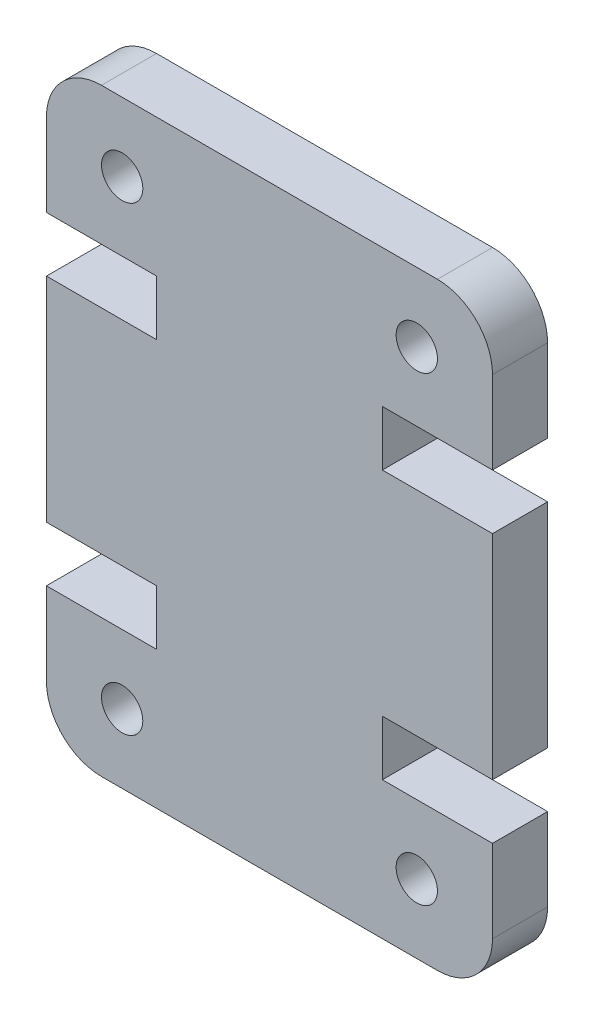
ISO-10303-21;
HEADER;
FILE_DESCRIPTION(('STEP AP214'),'2;1');
FILE_NAME('part.step','',(''),(''),'','','');
FILE_SCHEMA(('AUTOMOTIVE_DESIGN { 1 0 10303 214 1 1 1 1 }'));
ENDSEC;
DATA;
#1=APPLICATION_CONTEXT('core data for automotive mechanical design processes');
#2=APPLICATION_PROTOCOL_DEFINITION('international standard','automotive_design',2000,#1);
#3=PRODUCT_CONTEXT('',#1,'mechanical');
#4=PRODUCT('Part','Part','',(#3));
#5=PRODUCT_RELATED_PRODUCT_CATEGORY('part','',(#4));
#6=PRODUCT_DEFINITION_FORMATION('','',#4);
#7=PRODUCT_DEFINITION_CONTEXT('part definition',#1,'design');
#8=PRODUCT_DEFINITION('design','',#6,#7);
#9=PRODUCT_DEFINITION_SHAPE('','',#8);
#10=(LENGTH_UNIT() NAMED_UNIT(*) SI_UNIT(.MILLI.,.METRE.));
#11=(NAMED_UNIT(*) PLANE_ANGLE_UNIT() SI_UNIT($,.RADIAN.));
#12=(NAMED_UNIT(*) SI_UNIT($,.STERADIAN.) SOLID_ANGLE_UNIT());
#13=UNCERTAINTY_MEASURE_WITH_UNIT(LENGTH_MEASURE(1.E-05),#10,'distance_accuracy_value','');
#14=(GEOMETRIC_REPRESENTATION_CONTEXT(3) GLOBAL_UNCERTAINTY_ASSIGNED_CONTEXT((#13)) GLOBAL_UNIT_ASSIGNED_CONTEXT((#10,
#11,#12)) REPRESENTATION_CONTEXT('',''));
#15=CARTESIAN_POINT('',(0.,0.,0.));
#16=DIRECTION('',(0.,0.,1.));
#17=DIRECTION('',(1.,0.,0.));
#18=AXIS2_PLACEMENT_3D('',#15,#16,#17);
#19=CARTESIAN_POINT('',(14.2,2.,2.));
#20=DIRECTION('',(0.,0.,-1.));
#21=DIRECTION('',(-1.,0.,0.));
#22=AXIS2_PLACEMENT_3D('',#19,#20,#21);
#23=PLANE('',#22);
#24=CARTESIAN_POINT('',(2.75000000000004,19.2399999999998,2.));
#25=DIRECTION('',(0.,0.,1.));
#26=DIRECTION('',(-1.,0.,0.));
#27=AXIS2_PLACEMENT_3D('',#24,#25,#26);
#28=CIRCLE('',#27,0.75);
#29=CARTESIAN_POINT('',(2.00000000000004,19.2399999999998,2.));
#30=VERTEX_POINT('',#29);
#31=EDGE_CURVE('E448',#30,#30,#28,.T.);
#32=ORIENTED_EDGE('',*,*,#31,.F.);
#33=EDGE_LOOP('',(#32));
#34=FACE_BOUND('',#33,.T.);
#35=CARTESIAN_POINT('',(13.45,2.50000000000017,2.));
#36=DIRECTION('',(0.,0.,1.));
#37=DIRECTION('',(-1.,0.,0.));
#38=AXIS2_PLACEMENT_3D('',#35,#36,#37);
#39=CIRCLE('',#38,0.750000000000004);
#40=CARTESIAN_POINT('',(12.6999999999999,2.50000000000017,2.));
#41=VERTEX_POINT('',#40);
#42=EDGE_CURVE('E230',#41,#41,#39,.T.);
#43=ORIENTED_EDGE('',*,*,#42,.F.);
#44=EDGE_LOOP('',(#43));
#45=FACE_BOUND('',#44,.T.);
#46=CARTESIAN_POINT('',(14.2,2.,2.));
#47=DIRECTION('',(0.,0.,1.));
#48=DIRECTION('',(-1.,0.,0.));
#49=AXIS2_PLACEMENT_3D('',#46,#47,#48);
#50=CIRCLE('',#49,2.);
#51=CARTESIAN_POINT('',(14.2,0.,2.));
#52=VERTEX_POINT('',#51);
#53=CARTESIAN_POINT('',(16.2,2.,2.));
#54=VERTEX_POINT('',#53);
#55=EDGE_CURVE('E273',#52,#54,#50,.T.);
#56=ORIENTED_EDGE('',*,*,#55,.T.);
#57=DIRECTION('',(0.,1.,0.));
#58=VECTOR('',#57,1.);
#59=CARTESIAN_POINT('',(16.2,2.,2.));
#60=LINE('',#59,#58);
#61=CARTESIAN_POINT('',(16.2,4.99999999999945,2.));
#62=VERTEX_POINT('',#61);
#63=EDGE_CURVE('E141',#54,#62,#60,.T.);
#64=ORIENTED_EDGE('',*,*,#63,.T.);
#65=DIRECTION('',(-1.,0.,0.));
#66=VECTOR('',#65,1.);
#67=CARTESIAN_POINT('',(12.2,4.99999999999945,2.));
#68=LINE('',#67,#66);
#69=CARTESIAN_POINT('',(12.2,4.99999999999945,2.));
#70=VERTEX_POINT('',#69);
#71=EDGE_CURVE('E336',#62,#70,#68,.T.);
#72=ORIENTED_EDGE('',*,*,#71,.T.);
#73=DIRECTION('',(0.,1.,0.));
#74=VECTOR('',#73,1.);
#75=CARTESIAN_POINT('',(12.2,6.99999999999945,2.));
#76=LINE('',#75,#74);
#77=CARTESIAN_POINT('',(12.2,6.99999999999945,2.));
#78=VERTEX_POINT('',#77);
#79=EDGE_CURVE('E355',#70,#78,#76,.T.);
#80=ORIENTED_EDGE('',*,*,#79,.T.);
#81=DIRECTION('',(1.,0.,0.));
#82=VECTOR('',#81,1.);
#83=CARTESIAN_POINT('',(16.2,6.99999999999945,2.));
#84=LINE('',#83,#82);
#85=CARTESIAN_POINT('',(16.2,6.99999999999945,2.));
#86=VERTEX_POINT('',#85);
#87=EDGE_CURVE('E352',#78,#86,#84,.T.);
#88=ORIENTED_EDGE('',*,*,#87,.T.);
#89=DIRECTION('',(0.,1.,0.));
#90=VECTOR('',#89,1.);
#91=CARTESIAN_POINT('',(16.2,14.7400000000005,2.));
#92=LINE('',#91,#90);
#93=CARTESIAN_POINT('',(16.2,14.7400000000005,2.));
#94=VERTEX_POINT('',#93);
#95=EDGE_CURVE('E354',#86,#94,#92,.T.);
#96=ORIENTED_EDGE('',*,*,#95,.T.);
#97=DIRECTION('',(-1.,0.,0.));
#98=VECTOR('',#97,1.);
#99=CARTESIAN_POINT('',(16.2,14.7400000000005,2.));
#100=LINE('',#99,#98);
#101=CARTESIAN_POINT('',(12.2,14.7400000000005,2.));
#102=VERTEX_POINT('',#101);
#103=EDGE_CURVE('E357',#94,#102,#100,.T.);
#104=ORIENTED_EDGE('',*,*,#103,.T.);
#105=DIRECTION('',(0.,1.,0.));
#106=VECTOR('',#105,1.);
#107=CARTESIAN_POINT('',(12.2,14.7400000000005,2.));
#108=LINE('',#107,#106);
#109=CARTESIAN_POINT('',(12.2,16.7400000000005,2.));
#110=VERTEX_POINT('',#109);
#111=EDGE_CURVE('E363',#102,#110,#108,.T.);
#112=ORIENTED_EDGE('',*,*,#111,.T.);
#113=DIRECTION('',(1.,0.,0.));
#114=VECTOR('',#113,1.);
#115=CARTESIAN_POINT('',(12.2,16.7400000000005,2.));
#116=LINE('',#115,#114);
#117=CARTESIAN_POINT('',(16.2,16.7400000000005,2.));
#118=VERTEX_POINT('',#117);
#119=EDGE_CURVE('E365',#110,#118,#116,.T.);
#120=ORIENTED_EDGE('',*,*,#119,.T.);
#121=DIRECTION('',(0.,1.,0.));
#122=VECTOR('',#121,1.);
#123=CARTESIAN_POINT('',(16.2,19.74,2.));
#124=LINE('',#123,#122);
#125=CARTESIAN_POINT('',(16.2,19.74,2.));
#126=VERTEX_POINT('',#125);
#127=EDGE_CURVE('E367',#118,#126,#124,.T.);
#128=ORIENTED_EDGE('',*,*,#127,.T.);
#129=CARTESIAN_POINT('',(14.2,19.74,2.));
#130=DIRECTION('',(0.,0.,1.));
#131=DIRECTION('',(1.,0.,0.));
#132=AXIS2_PLACEMENT_3D('',#129,#130,#131);
#133=CIRCLE('',#132,2.);
#134=CARTESIAN_POINT('',(14.2,21.74,2.));
#135=VERTEX_POINT('',#134);
#136=EDGE_CURVE('E369',#126,#135,#133,.T.);
#137=ORIENTED_EDGE('',*,*,#136,.T.);
#138=DIRECTION('',(-1.,0.,0.));
#139=VECTOR('',#138,1.);
#140=CARTESIAN_POINT('',(1.99999999999999,21.74,2.));
#141=LINE('',#140,#139);
#142=CARTESIAN_POINT('',(1.99999999999999,21.74,2.));
#143=VERTEX_POINT('',#142);
#144=EDGE_CURVE('E371',#135,#143,#141,.T.);
#145=ORIENTED_EDGE('',*,*,#144,.T.);
#146=CARTESIAN_POINT('',(2.,19.74,2.));
#147=DIRECTION('',(0.,0.,1.));
#148=DIRECTION('',(-1.,0.,0.));
#149=AXIS2_PLACEMENT_3D('',#146,#147,#148);
#150=CIRCLE('',#149,2.);
#151=CARTESIAN_POINT('',(0.,19.74,2.));
#152=VERTEX_POINT('',#151);
#153=EDGE_CURVE('E373',#143,#152,#150,.T.);
#154=ORIENTED_EDGE('',*,*,#153,.T.);
#155=DIRECTION('',(0.,-1.,0.));
#156=VECTOR('',#155,1.);
#157=CARTESIAN_POINT('',(0.,19.74,2.));
#158=LINE('',#157,#156);
#159=CARTESIAN_POINT('',(0.,16.7400000000005,2.));
#160=VERTEX_POINT('',#159);
#161=EDGE_CURVE('E375',#152,#160,#158,.T.);
#162=ORIENTED_EDGE('',*,*,#161,.T.);
#163=DIRECTION('',(1.,0.,0.));
#164=VECTOR('',#163,1.);
#165=CARTESIAN_POINT('',(4.,16.7400000000005,2.));
#166=LINE('',#165,#164);
#167=CARTESIAN_POINT('',(4.,16.7400000000005,2.));
#168=VERTEX_POINT('',#167);
#169=EDGE_CURVE('E377',#160,#168,#166,.T.);
#170=ORIENTED_EDGE('',*,*,#169,.T.);
#171=DIRECTION('',(0.,-1.,0.));
#172=VECTOR('',#171,1.);
#173=CARTESIAN_POINT('',(4.,14.7400000000005,2.));
#174=LINE('',#173,#172);
#175=CARTESIAN_POINT('',(4.,14.7400000000005,2.));
#176=VERTEX_POINT('',#175);
#177=EDGE_CURVE('E379',#168,#176,#174,.T.);
#178=ORIENTED_EDGE('',*,*,#177,.T.);
#179=DIRECTION('',(-1.,0.,0.));
#180=VECTOR('',#179,1.);
#181=CARTESIAN_POINT('',(0.,14.7400000000005,2.));
#182=LINE('',#181,#180);
#183=CARTESIAN_POINT('',(0.,14.7400000000005,2.));
#184=VERTEX_POINT('',#183);
#185=EDGE_CURVE('E381',#176,#184,#182,.T.);
#186=ORIENTED_EDGE('',*,*,#185,.T.);
#187=DIRECTION('',(0.,-1.,0.));
#188=VECTOR('',#187,1.);
#189=CARTESIAN_POINT('',(0.,14.7400000000005,2.));
#190=LINE('',#189,#188);
#191=CARTESIAN_POINT('',(0.,6.99999999999946,2.));
#192=VERTEX_POINT('',#191);
#193=EDGE_CURVE('E383',#184,#192,#190,.T.);
#194=ORIENTED_EDGE('',*,*,#193,.T.);
#195=DIRECTION('',(1.,0.,0.));
#196=VECTOR('',#195,1.);
#197=CARTESIAN_POINT('',(0.,6.99999999999946,2.));
#198=LINE('',#197,#196);
#199=CARTESIAN_POINT('',(4.00000000000002,6.99999999999946,2.));
#200=VERTEX_POINT('',#199);
#201=EDGE_CURVE('E385',#192,#200,#198,.T.);
#202=ORIENTED_EDGE('',*,*,#201,.T.);
#203=DIRECTION('',(0.,-1.,0.));
#204=VECTOR('',#203,1.);
#205=CARTESIAN_POINT('',(4.00000000000002,6.99999999999946,2.));
#206=LINE('',#205,#204);
#207=CARTESIAN_POINT('',(4.,4.99999999999945,2.));
#208=VERTEX_POINT('',#207);
#209=EDGE_CURVE('E387',#200,#208,#206,.T.);
#210=ORIENTED_EDGE('',*,*,#209,.T.);
#211=DIRECTION('',(-1.,0.,0.));
#212=VECTOR('',#211,1.);
#213=CARTESIAN_POINT('',(4.,4.99999999999945,2.));
#214=LINE('',#213,#212);
#215=CARTESIAN_POINT('',(0.,4.99999999999945,2.));
#216=VERTEX_POINT('',#215);
#217=EDGE_CURVE('E208',#208,#216,#214,.T.);
#218=ORIENTED_EDGE('',*,*,#217,.T.);
#219=DIRECTION('',(0.,-1.,0.));
#220=VECTOR('',#219,1.);
#221=CARTESIAN_POINT('',(0.,2.,2.));
#222=LINE('',#221,#220);
#223=CARTESIAN_POINT('',(0.,2.,2.));
#224=VERTEX_POINT('',#223);
#225=EDGE_CURVE('E202',#216,#224,#222,.T.);
#226=ORIENTED_EDGE('',*,*,#225,.T.);
#227=CARTESIAN_POINT('',(2.00000000000002,2.,2.));
#228=DIRECTION('',(0.,0.,1.));
#229=DIRECTION('',(1.,0.,0.));
#230=AXIS2_PLACEMENT_3D('',#227,#228,#229);
#231=CIRCLE('',#230,2.00000000000001);
#232=CARTESIAN_POINT('',(2.00000000000002,0.,2.));
#233=VERTEX_POINT('',#232);
#234=EDGE_CURVE('E206',#224,#233,#231,.T.);
#235=ORIENTED_EDGE('',*,*,#234,.T.);
#236=DIRECTION('',(1.,0.,0.));
#237=VECTOR('',#236,1.);
#238=CARTESIAN_POINT('',(2.00000000000002,0.,2.));
#239=LINE('',#238,#237);
#240=EDGE_CURVE('E50',#233,#52,#239,.T.);
#241=ORIENTED_EDGE('',*,*,#240,.T.);
#242=EDGE_LOOP('',(#56,#64,#72,#80,#88,#96,#104,#112,#120,#128,#137,#145,#154,#162,#170,#178,
#186,#194,#202,#210,#218,#226,#235,#241));
#243=FACE_BOUND('',#242,.T.);
#244=CARTESIAN_POINT('',(2.75000000000004,2.50000000000017,2.));
#245=DIRECTION('',(0.,0.,1.));
#246=DIRECTION('',(1.,0.,0.));
#247=AXIS2_PLACEMENT_3D('',#244,#245,#246);
#248=CIRCLE('',#247,0.75);
#249=CARTESIAN_POINT('',(3.50000000000004,2.50000000000017,2.));
#250=VERTEX_POINT('',#249);
#251=EDGE_CURVE('E454',#250,#250,#248,.T.);
#252=ORIENTED_EDGE('',*,*,#251,.F.);
#253=EDGE_LOOP('',(#252));
#254=FACE_BOUND('',#253,.T.);
#255=CARTESIAN_POINT('',(13.45,19.2399999999998,2.));
#256=DIRECTION('',(0.,0.,1.));
#257=DIRECTION('',(1.,0.,0.));
#258=AXIS2_PLACEMENT_3D('',#255,#256,#257);
#259=CIRCLE('',#258,0.750000000000004);
#260=CARTESIAN_POINT('',(14.2,19.2399999999998,2.));
#261=VERTEX_POINT('',#260);
#262=EDGE_CURVE('E439',#261,#261,#259,.T.);
#263=ORIENTED_EDGE('',*,*,#262,.F.);
#264=EDGE_LOOP('',(#263));
#265=FACE_BOUND('',#264,.T.);
#266=ADVANCED_FACE('F33',(#34,#45,#243,#254,#265),#23,.F.);
#267=CARTESIAN_POINT('',(14.2,2.,0.));
#268=DIRECTION('',(0.,0.,-1.));
#269=DIRECTION('',(-1.,0.,0.));
#270=AXIS2_PLACEMENT_3D('',#267,#268,#269);
#271=PLANE('',#270);
#272=CARTESIAN_POINT('',(2.75000000000004,19.2399999999998,0.));
#273=DIRECTION('',(0.,0.,1.));
#274=DIRECTION('',(-1.,0.,0.));
#275=AXIS2_PLACEMENT_3D('',#272,#273,#274);
#276=CIRCLE('',#275,0.75);
#277=CARTESIAN_POINT('',(2.00000000000004,19.2399999999998,0.));
#278=VERTEX_POINT('',#277);
#279=EDGE_CURVE('E445',#278,#278,#276,.T.);
#280=ORIENTED_EDGE('',*,*,#279,.T.);
#281=EDGE_LOOP('',(#280));
#282=FACE_BOUND('',#281,.T.);
#283=CARTESIAN_POINT('',(13.45,2.50000000000017,0.));
#284=DIRECTION('',(0.,0.,1.));
#285=DIRECTION('',(-1.,0.,0.));
#286=AXIS2_PLACEMENT_3D('',#283,#284,#285);
#287=CIRCLE('',#286,0.750000000000004);
#288=CARTESIAN_POINT('',(12.6999999999999,2.50000000000017,0.));
#289=VERTEX_POINT('',#288);
#290=EDGE_CURVE('E457',#289,#289,#287,.T.);
#291=ORIENTED_EDGE('',*,*,#290,.T.);
#292=EDGE_LOOP('',(#291));
#293=FACE_BOUND('',#292,.T.);
#294=CARTESIAN_POINT('',(14.2,2.,0.));
#295=DIRECTION('',(0.,0.,1.));
#296=DIRECTION('',(-1.,0.,0.));
#297=AXIS2_PLACEMENT_3D('',#294,#295,#296);
#298=CIRCLE('',#297,2.);
#299=CARTESIAN_POINT('',(14.2,0.,0.));
#300=VERTEX_POINT('',#299);
#301=CARTESIAN_POINT('',(16.2,2.,0.));
#302=VERTEX_POINT('',#301);
#303=EDGE_CURVE('E226',#300,#302,#298,.T.);
#304=ORIENTED_EDGE('',*,*,#303,.F.);
#305=DIRECTION('',(1.,0.,0.));
#306=VECTOR('',#305,1.);
#307=CARTESIAN_POINT('',(2.00000000000002,0.,0.));
#308=LINE('',#307,#306);
#309=CARTESIAN_POINT('',(2.00000000000002,0.,0.));
#310=VERTEX_POINT('',#309);
#311=EDGE_CURVE('E133',#310,#300,#308,.T.);
#312=ORIENTED_EDGE('',*,*,#311,.F.);
#313=CARTESIAN_POINT('',(2.00000000000002,2.,0.));
#314=DIRECTION('',(0.,0.,1.));
#315=DIRECTION('',(1.,0.,0.));
#316=AXIS2_PLACEMENT_3D('',#313,#314,#315);
#317=CIRCLE('',#316,2.00000000000001);
#318=CARTESIAN_POINT('',(0.,2.,0.));
#319=VERTEX_POINT('',#318);
#320=EDGE_CURVE('E127',#319,#310,#317,.T.);
#321=ORIENTED_EDGE('',*,*,#320,.F.);
#322=DIRECTION('',(0.,-1.,0.));
#323=VECTOR('',#322,1.);
#324=CARTESIAN_POINT('',(0.,2.,0.));
#325=LINE('',#324,#323);
#326=CARTESIAN_POINT('',(0.,4.99999999999945,0.));
#327=VERTEX_POINT('',#326);
#328=EDGE_CURVE('E216',#327,#319,#325,.T.);
#329=ORIENTED_EDGE('',*,*,#328,.F.);
#330=DIRECTION('',(-1.,0.,0.));
#331=VECTOR('',#330,1.);
#332=CARTESIAN_POINT('',(4.,4.99999999999945,0.));
#333=LINE('',#332,#331);
#334=CARTESIAN_POINT('',(4.,4.99999999999945,0.));
#335=VERTEX_POINT('',#334);
#336=EDGE_CURVE('E268',#335,#327,#333,.T.);
#337=ORIENTED_EDGE('',*,*,#336,.F.);
#338=DIRECTION('',(0.,-1.,0.));
#339=VECTOR('',#338,1.);
#340=CARTESIAN_POINT('',(4.00000000000002,6.99999999999946,0.));
#341=LINE('',#340,#339);
#342=CARTESIAN_POINT('',(4.00000000000002,6.99999999999946,0.));
#343=VERTEX_POINT('',#342);
#344=EDGE_CURVE('E266',#343,#335,#341,.T.);
#345=ORIENTED_EDGE('',*,*,#344,.F.);
#346=DIRECTION('',(1.,0.,0.));
#347=VECTOR('',#346,1.);
#348=CARTESIAN_POINT('',(0.,6.99999999999946,0.));
#349=LINE('',#348,#347);
#350=CARTESIAN_POINT('',(0.,6.99999999999946,0.));
#351=VERTEX_POINT('',#350);
#352=EDGE_CURVE('E264',#351,#343,#349,.T.);
#353=ORIENTED_EDGE('',*,*,#352,.F.);
#354=DIRECTION('',(0.,-1.,0.));
#355=VECTOR('',#354,1.);
#356=CARTESIAN_POINT('',(0.,14.7400000000005,0.));
#357=LINE('',#356,#355);
#358=CARTESIAN_POINT('',(0.,14.7400000000005,0.));
#359=VERTEX_POINT('',#358);
#360=EDGE_CURVE('E262',#359,#351,#357,.T.);
#361=ORIENTED_EDGE('',*,*,#360,.F.);
#362=DIRECTION('',(-1.,0.,0.));
#363=VECTOR('',#362,1.);
#364=CARTESIAN_POINT('',(0.,14.7400000000005,0.));
#365=LINE('',#364,#363);
#366=CARTESIAN_POINT('',(4.,14.7400000000005,0.));
#367=VERTEX_POINT('',#366);
#368=EDGE_CURVE('E260',#367,#359,#365,.T.);
#369=ORIENTED_EDGE('',*,*,#368,.F.);
#370=DIRECTION('',(0.,-1.,0.));
#371=VECTOR('',#370,1.);
#372=CARTESIAN_POINT('',(4.,14.7400000000005,0.));
#373=LINE('',#372,#371);
#374=CARTESIAN_POINT('',(4.,16.7400000000005,0.));
#375=VERTEX_POINT('',#374);
#376=EDGE_CURVE('E258',#375,#367,#373,.T.);
#377=ORIENTED_EDGE('',*,*,#376,.F.);
#378=DIRECTION('',(1.,0.,0.));
#379=VECTOR('',#378,1.);
#380=CARTESIAN_POINT('',(4.,16.7400000000005,0.));
#381=LINE('',#380,#379);
#382=CARTESIAN_POINT('',(0.,16.7400000000005,0.));
#383=VERTEX_POINT('',#382);
#384=EDGE_CURVE('E256',#383,#375,#381,.T.);
#385=ORIENTED_EDGE('',*,*,#384,.F.);
#386=DIRECTION('',(0.,-1.,0.));
#387=VECTOR('',#386,1.);
#388=CARTESIAN_POINT('',(0.,19.74,0.));
#389=LINE('',#388,#387);
#390=CARTESIAN_POINT('',(0.,19.74,0.));
#391=VERTEX_POINT('',#390);
#392=EDGE_CURVE('E254',#391,#383,#389,.T.);
#393=ORIENTED_EDGE('',*,*,#392,.F.);
#394=CARTESIAN_POINT('',(2.,19.74,0.));
#395=DIRECTION('',(0.,0.,1.));
#396=DIRECTION('',(-1.,0.,0.));
#397=AXIS2_PLACEMENT_3D('',#394,#395,#396);
#398=CIRCLE('',#397,2.);
#399=CARTESIAN_POINT('',(1.99999999999999,21.74,0.));
#400=VERTEX_POINT('',#399);
#401=EDGE_CURVE('E252',#400,#391,#398,.T.);
#402=ORIENTED_EDGE('',*,*,#401,.F.);
#403=DIRECTION('',(-1.,0.,0.));
#404=VECTOR('',#403,1.);
#405=CARTESIAN_POINT('',(1.99999999999999,21.74,0.));
#406=LINE('',#405,#404);
#407=CARTESIAN_POINT('',(14.2,21.74,0.));
#408=VERTEX_POINT('',#407);
#409=EDGE_CURVE('E250',#408,#400,#406,.T.);
#410=ORIENTED_EDGE('',*,*,#409,.F.);
#411=CARTESIAN_POINT('',(14.2,19.74,0.));
#412=DIRECTION('',(0.,0.,1.));
#413=DIRECTION('',(1.,0.,0.));
#414=AXIS2_PLACEMENT_3D('',#411,#412,#413);
#415=CIRCLE('',#414,2.);
#416=CARTESIAN_POINT('',(16.2,19.74,0.));
#417=VERTEX_POINT('',#416);
#418=EDGE_CURVE('E248',#417,#408,#415,.T.);
#419=ORIENTED_EDGE('',*,*,#418,.F.);
#420=DIRECTION('',(0.,1.,0.));
#421=VECTOR('',#420,1.);
#422=CARTESIAN_POINT('',(16.2,19.74,0.));
#423=LINE('',#422,#421);
#424=CARTESIAN_POINT('',(16.2,16.7400000000005,0.));
#425=VERTEX_POINT('',#424);
#426=EDGE_CURVE('E246',#425,#417,#423,.T.);
#427=ORIENTED_EDGE('',*,*,#426,.F.);
#428=DIRECTION('',(1.,0.,0.));
#429=VECTOR('',#428,1.);
#430=CARTESIAN_POINT('',(12.2,16.7400000000005,0.));
#431=LINE('',#430,#429);
#432=CARTESIAN_POINT('',(12.2,16.7400000000005,0.));
#433=VERTEX_POINT('',#432);
#434=EDGE_CURVE('E244',#433,#425,#431,.T.);
#435=ORIENTED_EDGE('',*,*,#434,.F.);
#436=DIRECTION('',(0.,1.,0.));
#437=VECTOR('',#436,1.);
#438=CARTESIAN_POINT('',(12.2,14.7400000000005,0.));
#439=LINE('',#438,#437);
#440=CARTESIAN_POINT('',(12.2,14.7400000000005,0.));
#441=VERTEX_POINT('',#440);
#442=EDGE_CURVE('E242',#441,#433,#439,.T.);
#443=ORIENTED_EDGE('',*,*,#442,.F.);
#444=DIRECTION('',(-1.,0.,0.));
#445=VECTOR('',#444,1.);
#446=CARTESIAN_POINT('',(16.2,14.7400000000005,0.));
#447=LINE('',#446,#445);
#448=CARTESIAN_POINT('',(16.2,14.7400000000005,0.));
#449=VERTEX_POINT('',#448);
#450=EDGE_CURVE('E240',#449,#441,#447,.T.);
#451=ORIENTED_EDGE('',*,*,#450,.F.);
#452=DIRECTION('',(0.,1.,0.));
#453=VECTOR('',#452,1.);
#454=CARTESIAN_POINT('',(16.2,14.7400000000005,0.));
#455=LINE('',#454,#453);
#456=CARTESIAN_POINT('',(16.2,6.99999999999945,0.));
#457=VERTEX_POINT('',#456);
#458=EDGE_CURVE('E238',#457,#449,#455,.T.);
#459=ORIENTED_EDGE('',*,*,#458,.F.);
#460=DIRECTION('',(1.,0.,0.));
#461=VECTOR('',#460,1.);
#462=CARTESIAN_POINT('',(16.2,6.99999999999945,0.));
#463=LINE('',#462,#461);
#464=CARTESIAN_POINT('',(12.2,6.99999999999945,0.));
#465=VERTEX_POINT('',#464);
#466=EDGE_CURVE('E236',#465,#457,#463,.T.);
#467=ORIENTED_EDGE('',*,*,#466,.F.);
#468=DIRECTION('',(0.,1.,0.));
#469=VECTOR('',#468,1.);
#470=CARTESIAN_POINT('',(12.2,6.99999999999945,0.));
#471=LINE('',#470,#469);
#472=CARTESIAN_POINT('',(12.2,4.99999999999945,0.));
#473=VERTEX_POINT('',#472);
#474=EDGE_CURVE('E234',#473,#465,#471,.T.);
#475=ORIENTED_EDGE('',*,*,#474,.F.);
#476=DIRECTION('',(-1.,0.,0.));
#477=VECTOR('',#476,1.);
#478=CARTESIAN_POINT('',(12.2,4.99999999999945,0.));
#479=LINE('',#478,#477);
#480=CARTESIAN_POINT('',(16.2,4.99999999999945,0.));
#481=VERTEX_POINT('',#480);
#482=EDGE_CURVE('E232',#481,#473,#479,.T.);
#483=ORIENTED_EDGE('',*,*,#482,.F.);
#484=DIRECTION('',(0.,1.,0.));
#485=VECTOR('',#484,1.);
#486=CARTESIAN_POINT('',(16.2,2.,0.));
#487=LINE('',#486,#485);
#488=EDGE_CURVE('E229',#302,#481,#487,.T.);
#489=ORIENTED_EDGE('',*,*,#488,.F.);
#490=EDGE_LOOP('',(#304,#312,#321,#329,#337,#345,#353,#361,#369,#377,#385,#393,#402,#410,#419,
#427,#435,#443,#451,#459,#467,#475,#483,#489));
#491=FACE_BOUND('',#490,.T.);
#492=CARTESIAN_POINT('',(2.75000000000004,2.50000000000017,0.));
#493=DIRECTION('',(0.,0.,1.));
#494=DIRECTION('',(1.,0.,0.));
#495=AXIS2_PLACEMENT_3D('',#492,#493,#494);
#496=CIRCLE('',#495,0.75);
#497=CARTESIAN_POINT('',(3.50000000000004,2.50000000000017,0.));
#498=VERTEX_POINT('',#497);
#499=EDGE_CURVE('E451',#498,#498,#496,.T.);
#500=ORIENTED_EDGE('',*,*,#499,.T.);
#501=EDGE_LOOP('',(#500));
#502=FACE_BOUND('',#501,.T.);
#503=CARTESIAN_POINT('',(13.45,19.2399999999998,0.));
#504=DIRECTION('',(0.,0.,1.));
#505=DIRECTION('',(1.,0.,0.));
#506=AXIS2_PLACEMENT_3D('',#503,#504,#505);
#507=CIRCLE('',#506,0.750000000000004);
#508=CARTESIAN_POINT('',(14.2,19.2399999999998,0.));
#509=VERTEX_POINT('',#508);
#510=EDGE_CURVE('E442',#509,#509,#507,.T.);
#511=ORIENTED_EDGE('',*,*,#510,.T.);
#512=EDGE_LOOP('',(#511));
#513=FACE_BOUND('',#512,.T.);
#514=ADVANCED_FACE('F340',(#282,#293,#491,#502,#513),#271,.T.);
#515=CARTESIAN_POINT('',(14.2,2.,2.));
#516=DIRECTION('',(0.,0.,-1.));
#517=DIRECTION('',(-1.,0.,0.));
#518=AXIS2_PLACEMENT_3D('',#515,#516,#517);
#519=CYLINDRICAL_SURFACE('',#518,2.);
#520=ORIENTED_EDGE('',*,*,#303,.T.);
#521=DIRECTION('',(0.,0.,-1.));
#522=VECTOR('',#521,1.);
#523=CARTESIAN_POINT('',(16.2,2.,2.));
#524=LINE('',#523,#522);
#525=EDGE_CURVE('E11',#54,#302,#524,.T.);
#526=ORIENTED_EDGE('',*,*,#525,.F.);
#527=ORIENTED_EDGE('',*,*,#55,.F.);
#528=DIRECTION('',(0.,0.,-1.));
#529=VECTOR('',#528,1.);
#530=CARTESIAN_POINT('',(14.2,0.,2.));
#531=LINE('',#530,#529);
#532=EDGE_CURVE('E222',#52,#300,#531,.T.);
#533=ORIENTED_EDGE('',*,*,#532,.T.);
#534=EDGE_LOOP('',(#520,#526,#527,#533));
#535=FACE_BOUND('',#534,.T.);
#536=ADVANCED_FACE('F35',(#535),#519,.T.);
#537=CARTESIAN_POINT('',(16.2,2.,2.));
#538=DIRECTION('',(-1.,0.,0.));
#539=DIRECTION('',(0.,0.,1.));
#540=AXIS2_PLACEMENT_3D('',#537,#538,#539);
#541=PLANE('',#540);
#542=ORIENTED_EDGE('',*,*,#488,.T.);
#543=DIRECTION('',(0.,0.,-1.));
#544=VECTOR('',#543,1.);
#545=CARTESIAN_POINT('',(16.2,4.99999999999945,2.));
#546=LINE('',#545,#544);
#547=EDGE_CURVE('E42',#62,#481,#546,.T.);
#548=ORIENTED_EDGE('',*,*,#547,.F.);
#549=ORIENTED_EDGE('',*,*,#63,.F.);
#550=ORIENTED_EDGE('',*,*,#525,.T.);
#551=EDGE_LOOP('',(#542,#548,#549,#550));
#552=FACE_BOUND('',#551,.T.);
#553=ADVANCED_FACE('F686',(#552),#541,.F.);
#554=CARTESIAN_POINT('',(12.2,4.99999999999945,2.));
#555=DIRECTION('',(0.,-1.,0.));
#556=DIRECTION('',(0.,0.,-1.));
#557=AXIS2_PLACEMENT_3D('',#554,#555,#556);
#558=PLANE('',#557);
#559=ORIENTED_EDGE('',*,*,#482,.T.);
#560=DIRECTION('',(0.,0.,-1.));
#561=VECTOR('',#560,1.);
#562=CARTESIAN_POINT('',(12.2,4.99999999999945,2.));
#563=LINE('',#562,#561);
#564=EDGE_CURVE('E328',#70,#473,#563,.T.);
#565=ORIENTED_EDGE('',*,*,#564,.F.);
#566=ORIENTED_EDGE('',*,*,#71,.F.);
#567=ORIENTED_EDGE('',*,*,#547,.T.);
#568=EDGE_LOOP('',(#559,#565,#566,#567));
#569=FACE_BOUND('',#568,.T.);
#570=ADVANCED_FACE('F334',(#569),#558,.F.);
#571=CARTESIAN_POINT('',(12.2,6.99999999999945,2.));
#572=DIRECTION('',(-1.,0.,0.));
#573=DIRECTION('',(0.,0.,1.));
#574=AXIS2_PLACEMENT_3D('',#571,#572,#573);
#575=PLANE('',#574);
#576=ORIENTED_EDGE('',*,*,#474,.T.);
#577=DIRECTION('',(0.,0.,-1.));
#578=VECTOR('',#577,1.);
#579=CARTESIAN_POINT('',(12.2,6.99999999999945,2.));
#580=LINE('',#579,#578);
#581=EDGE_CURVE('E325',#78,#465,#580,.T.);
#582=ORIENTED_EDGE('',*,*,#581,.F.);
#583=ORIENTED_EDGE('',*,*,#79,.F.);
#584=ORIENTED_EDGE('',*,*,#564,.T.);
#585=EDGE_LOOP('',(#576,#582,#583,#584));
#586=FACE_BOUND('',#585,.T.);
#587=ADVANCED_FACE('F346',(#586),#575,.F.);
#588=CARTESIAN_POINT('',(16.2,6.99999999999945,2.));
#589=DIRECTION('',(0.,1.,0.));
#590=DIRECTION('',(-1.,0.,0.));
#591=AXIS2_PLACEMENT_3D('',#588,#589,#590);
#592=PLANE('',#591);
#593=ORIENTED_EDGE('',*,*,#466,.T.);
#594=DIRECTION('',(0.,0.,-1.));
#595=VECTOR('',#594,1.);
#596=CARTESIAN_POINT('',(16.2,6.99999999999945,2.));
#597=LINE('',#596,#595);
#598=EDGE_CURVE('E322',#86,#457,#597,.T.);
#599=ORIENTED_EDGE('',*,*,#598,.F.);
#600=ORIENTED_EDGE('',*,*,#87,.F.);
#601=ORIENTED_EDGE('',*,*,#581,.T.);
#602=EDGE_LOOP('',(#593,#599,#600,#601));
#603=FACE_BOUND('',#602,.T.);
#604=ADVANCED_FACE('F350',(#603),#592,.F.);
#605=CARTESIAN_POINT('',(16.2,14.7400000000005,2.));
#606=DIRECTION('',(-1.,0.,0.));
#607=DIRECTION('',(0.,0.,1.));
#608=AXIS2_PLACEMENT_3D('',#605,#606,#607);
#609=PLANE('',#608);
#610=ORIENTED_EDGE('',*,*,#458,.T.);
#611=DIRECTION('',(0.,0.,-1.));
#612=VECTOR('',#611,1.);
#613=CARTESIAN_POINT('',(16.2,14.7400000000005,2.));
#614=LINE('',#613,#612);
#615=EDGE_CURVE('E319',#94,#449,#614,.T.);
#616=ORIENTED_EDGE('',*,*,#615,.F.);
#617=ORIENTED_EDGE('',*,*,#95,.F.);
#618=ORIENTED_EDGE('',*,*,#598,.T.);
#619=EDGE_LOOP('',(#610,#616,#617,#618));
#620=FACE_BOUND('',#619,.T.);
#621=ADVANCED_FACE('F651',(#620),#609,.F.);
#622=CARTESIAN_POINT('',(16.2,14.7400000000005,2.));
#623=DIRECTION('',(0.,-1.,0.));
#624=DIRECTION('',(1.,0.,0.));
#625=AXIS2_PLACEMENT_3D('',#622,#623,#624);
#626=PLANE('',#625);
#627=ORIENTED_EDGE('',*,*,#450,.T.);
#628=DIRECTION('',(0.,0.,-1.));
#629=VECTOR('',#628,1.);
#630=CARTESIAN_POINT('',(12.2,14.7400000000005,2.));
#631=LINE('',#630,#629);
#632=EDGE_CURVE('E316',#102,#441,#631,.T.);
#633=ORIENTED_EDGE('',*,*,#632,.F.);
#634=ORIENTED_EDGE('',*,*,#103,.F.);
#635=ORIENTED_EDGE('',*,*,#615,.T.);
#636=EDGE_LOOP('',(#627,#633,#634,#635));
#637=FACE_BOUND('',#636,.T.);
#638=ADVANCED_FACE('F641',(#637),#626,.F.);
#639=CARTESIAN_POINT('',(12.2,14.7400000000005,2.));
#640=DIRECTION('',(-1.,0.,0.));
#641=DIRECTION('',(0.,0.,1.));
#642=AXIS2_PLACEMENT_3D('',#639,#640,#641);
#643=PLANE('',#642);
#644=ORIENTED_EDGE('',*,*,#442,.T.);
#645=DIRECTION('',(0.,0.,-1.));
#646=VECTOR('',#645,1.);
#647=CARTESIAN_POINT('',(12.2,16.7400000000005,2.));
#648=LINE('',#647,#646);
#649=EDGE_CURVE('E313',#110,#433,#648,.T.);
#650=ORIENTED_EDGE('',*,*,#649,.F.);
#651=ORIENTED_EDGE('',*,*,#111,.F.);
#652=ORIENTED_EDGE('',*,*,#632,.T.);
#653=EDGE_LOOP('',(#644,#650,#651,#652));
#654=FACE_BOUND('',#653,.T.);
#655=ADVANCED_FACE('F631',(#654),#643,.F.);
#656=CARTESIAN_POINT('',(12.2,16.7400000000005,2.));
#657=DIRECTION('',(0.,1.,0.));
#658=DIRECTION('',(0.,0.,1.));
#659=AXIS2_PLACEMENT_3D('',#656,#657,#658);
#660=PLANE('',#659);
#661=ORIENTED_EDGE('',*,*,#434,.T.);
#662=DIRECTION('',(0.,0.,-1.));
#663=VECTOR('',#662,1.);
#664=CARTESIAN_POINT('',(16.2,16.7400000000005,2.));
#665=LINE('',#664,#663);
#666=EDGE_CURVE('E310',#118,#425,#665,.T.);
#667=ORIENTED_EDGE('',*,*,#666,.F.);
#668=ORIENTED_EDGE('',*,*,#119,.F.);
#669=ORIENTED_EDGE('',*,*,#649,.T.);
#670=EDGE_LOOP('',(#661,#667,#668,#669));
#671=FACE_BOUND('',#670,.T.);
#672=ADVANCED_FACE('F621',(#671),#660,.F.);
#673=CARTESIAN_POINT('',(16.2,19.74,2.));
#674=DIRECTION('',(-1.,0.,0.));
#675=DIRECTION('',(0.,0.,1.));
#676=AXIS2_PLACEMENT_3D('',#673,#674,#675);
#677=PLANE('',#676);
#678=ORIENTED_EDGE('',*,*,#426,.T.);
#679=DIRECTION('',(0.,0.,-1.));
#680=VECTOR('',#679,1.);
#681=CARTESIAN_POINT('',(16.2,19.74,2.));
#682=LINE('',#681,#680);
#683=EDGE_CURVE('E307',#126,#417,#682,.T.);
#684=ORIENTED_EDGE('',*,*,#683,.F.);
#685=ORIENTED_EDGE('',*,*,#127,.F.);
#686=ORIENTED_EDGE('',*,*,#666,.T.);
#687=EDGE_LOOP('',(#678,#684,#685,#686));
#688=FACE_BOUND('',#687,.T.);
#689=ADVANCED_FACE('F611',(#688),#677,.F.);
#690=CARTESIAN_POINT('',(14.2,19.74,2.));
#691=DIRECTION('',(0.,0.,-1.));
#692=DIRECTION('',(-1.,0.,0.));
#693=AXIS2_PLACEMENT_3D('',#690,#691,#692);
#694=CYLINDRICAL_SURFACE('',#693,2.);
#695=ORIENTED_EDGE('',*,*,#418,.T.);
#696=DIRECTION('',(0.,0.,-1.));
#697=VECTOR('',#696,1.);
#698=CARTESIAN_POINT('',(14.2,21.74,2.));
#699=LINE('',#698,#697);
#700=EDGE_CURVE('E304',#135,#408,#699,.T.);
#701=ORIENTED_EDGE('',*,*,#700,.F.);
#702=ORIENTED_EDGE('',*,*,#136,.F.);
#703=ORIENTED_EDGE('',*,*,#683,.T.);
#704=EDGE_LOOP('',(#695,#701,#702,#703));
#705=FACE_BOUND('',#704,.T.);
#706=ADVANCED_FACE('F601',(#705),#694,.T.);
#707=CARTESIAN_POINT('',(1.99999999999999,21.74,2.));
#708=DIRECTION('',(0.,-1.,0.));
#709=DIRECTION('',(0.,0.,-1.));
#710=AXIS2_PLACEMENT_3D('',#707,#708,#709);
#711=PLANE('',#710);
#712=ORIENTED_EDGE('',*,*,#409,.T.);
#713=DIRECTION('',(0.,0.,-1.));
#714=VECTOR('',#713,1.);
#715=CARTESIAN_POINT('',(1.99999999999999,21.74,2.));
#716=LINE('',#715,#714);
#717=EDGE_CURVE('E301',#143,#400,#716,.T.);
#718=ORIENTED_EDGE('',*,*,#717,.F.);
#719=ORIENTED_EDGE('',*,*,#144,.F.);
#720=ORIENTED_EDGE('',*,*,#700,.T.);
#721=EDGE_LOOP('',(#712,#718,#719,#720));
#722=FACE_BOUND('',#721,.T.);
#723=ADVANCED_FACE('F591',(#722),#711,.F.);
#724=CARTESIAN_POINT('',(2.,19.74,2.));
#725=DIRECTION('',(0.,0.,-1.));
#726=DIRECTION('',(-1.,0.,0.));
#727=AXIS2_PLACEMENT_3D('',#724,#725,#726);
#728=CYLINDRICAL_SURFACE('',#727,2.);
#729=ORIENTED_EDGE('',*,*,#401,.T.);
#730=DIRECTION('',(0.,0.,-1.));
#731=VECTOR('',#730,1.);
#732=CARTESIAN_POINT('',(0.,19.74,2.));
#733=LINE('',#732,#731);
#734=EDGE_CURVE('E298',#152,#391,#733,.T.);
#735=ORIENTED_EDGE('',*,*,#734,.F.);
#736=ORIENTED_EDGE('',*,*,#153,.F.);
#737=ORIENTED_EDGE('',*,*,#717,.T.);
#738=EDGE_LOOP('',(#729,#735,#736,#737));
#739=FACE_BOUND('',#738,.T.);
#740=ADVANCED_FACE('F581',(#739),#728,.T.);
#741=CARTESIAN_POINT('',(0.,19.74,2.));
#742=DIRECTION('',(1.,0.,0.));
#743=DIRECTION('',(0.,1.,0.));
#744=AXIS2_PLACEMENT_3D('',#741,#742,#743);
#745=PLANE('',#744);
#746=ORIENTED_EDGE('',*,*,#392,.T.);
#747=DIRECTION('',(0.,0.,-1.));
#748=VECTOR('',#747,1.);
#749=CARTESIAN_POINT('',(0.,16.7400000000005,2.));
#750=LINE('',#749,#748);
#751=EDGE_CURVE('E295',#160,#383,#750,.T.);
#752=ORIENTED_EDGE('',*,*,#751,.F.);
#753=ORIENTED_EDGE('',*,*,#161,.F.);
#754=ORIENTED_EDGE('',*,*,#734,.T.);
#755=EDGE_LOOP('',(#746,#752,#753,#754));
#756=FACE_BOUND('',#755,.T.);
#757=ADVANCED_FACE('F571',(#756),#745,.F.);
#758=CARTESIAN_POINT('',(4.,16.7400000000005,2.));
#759=DIRECTION('',(0.,1.,0.));
#760=DIRECTION('',(-1.,0.,0.));
#761=AXIS2_PLACEMENT_3D('',#758,#759,#760);
#762=PLANE('',#761);
#763=ORIENTED_EDGE('',*,*,#384,.T.);
#764=DIRECTION('',(0.,0.,-1.));
#765=VECTOR('',#764,1.);
#766=CARTESIAN_POINT('',(4.,16.7400000000005,2.));
#767=LINE('',#766,#765);
#768=EDGE_CURVE('E292',#168,#375,#767,.T.);
#769=ORIENTED_EDGE('',*,*,#768,.F.);
#770=ORIENTED_EDGE('',*,*,#169,.F.);
#771=ORIENTED_EDGE('',*,*,#751,.T.);
#772=EDGE_LOOP('',(#763,#769,#770,#771));
#773=FACE_BOUND('',#772,.T.);
#774=ADVANCED_FACE('F561',(#773),#762,.F.);
#775=CARTESIAN_POINT('',(4.,14.7400000000005,2.));
#776=DIRECTION('',(1.,0.,0.));
#777=DIRECTION('',(0.,0.,-1.));
#778=AXIS2_PLACEMENT_3D('',#775,#776,#777);
#779=PLANE('',#778);
#780=ORIENTED_EDGE('',*,*,#376,.T.);
#781=DIRECTION('',(0.,0.,-1.));
#782=VECTOR('',#781,1.);
#783=CARTESIAN_POINT('',(4.,14.7400000000005,2.));
#784=LINE('',#783,#782);
#785=EDGE_CURVE('E289',#176,#367,#784,.T.);
#786=ORIENTED_EDGE('',*,*,#785,.F.);
#787=ORIENTED_EDGE('',*,*,#177,.F.);
#788=ORIENTED_EDGE('',*,*,#768,.T.);
#789=EDGE_LOOP('',(#780,#786,#787,#788));
#790=FACE_BOUND('',#789,.T.);
#791=ADVANCED_FACE('F551',(#790),#779,.F.);
#792=CARTESIAN_POINT('',(0.,14.7400000000005,2.));
#793=DIRECTION('',(0.,-1.,0.));
#794=DIRECTION('',(1.,0.,0.));
#795=AXIS2_PLACEMENT_3D('',#792,#793,#794);
#796=PLANE('',#795);
#797=ORIENTED_EDGE('',*,*,#368,.T.);
#798=DIRECTION('',(0.,0.,-1.));
#799=VECTOR('',#798,1.);
#800=CARTESIAN_POINT('',(0.,14.7400000000005,2.));
#801=LINE('',#800,#799);
#802=EDGE_CURVE('E286',#184,#359,#801,.T.);
#803=ORIENTED_EDGE('',*,*,#802,.F.);
#804=ORIENTED_EDGE('',*,*,#185,.F.);
#805=ORIENTED_EDGE('',*,*,#785,.T.);
#806=EDGE_LOOP('',(#797,#803,#804,#805));
#807=FACE_BOUND('',#806,.T.);
#808=ADVANCED_FACE('F541',(#807),#796,.F.);
#809=CARTESIAN_POINT('',(0.,14.7400000000005,2.));
#810=DIRECTION('',(1.,0.,0.));
#811=DIRECTION('',(0.,1.,0.));
#812=AXIS2_PLACEMENT_3D('',#809,#810,#811);
#813=PLANE('',#812);
#814=ORIENTED_EDGE('',*,*,#360,.T.);
#815=DIRECTION('',(0.,0.,-1.));
#816=VECTOR('',#815,1.);
#817=CARTESIAN_POINT('',(0.,6.99999999999946,2.));
#818=LINE('',#817,#816);
#819=EDGE_CURVE('E283',#192,#351,#818,.T.);
#820=ORIENTED_EDGE('',*,*,#819,.F.);
#821=ORIENTED_EDGE('',*,*,#193,.F.);
#822=ORIENTED_EDGE('',*,*,#802,.T.);
#823=EDGE_LOOP('',(#814,#820,#821,#822));
#824=FACE_BOUND('',#823,.T.);
#825=ADVANCED_FACE('F531',(#824),#813,.F.);
#826=CARTESIAN_POINT('',(0.,6.99999999999946,2.));
#827=DIRECTION('',(0.,1.,0.));
#828=DIRECTION('',(0.,0.,1.));
#829=AXIS2_PLACEMENT_3D('',#826,#827,#828);
#830=PLANE('',#829);
#831=ORIENTED_EDGE('',*,*,#352,.T.);
#832=DIRECTION('',(0.,0.,-1.));
#833=VECTOR('',#832,1.);
#834=CARTESIAN_POINT('',(4.00000000000002,6.99999999999946,2.));
#835=LINE('',#834,#833);
#836=EDGE_CURVE('E280',#200,#343,#835,.T.);
#837=ORIENTED_EDGE('',*,*,#836,.F.);
#838=ORIENTED_EDGE('',*,*,#201,.F.);
#839=ORIENTED_EDGE('',*,*,#819,.T.);
#840=EDGE_LOOP('',(#831,#837,#838,#839));
#841=FACE_BOUND('',#840,.T.);
#842=ADVANCED_FACE('F522',(#841),#830,.F.);
#843=CARTESIAN_POINT('',(4.00000000000002,6.99999999999946,2.));
#844=DIRECTION('',(1.,0.,0.));
#845=DIRECTION('',(0.,1.,0.));
#846=AXIS2_PLACEMENT_3D('',#843,#844,#845);
#847=PLANE('',#846);
#848=ORIENTED_EDGE('',*,*,#344,.T.);
#849=DIRECTION('',(0.,0.,-1.));
#850=VECTOR('',#849,1.);
#851=CARTESIAN_POINT('',(4.,4.99999999999945,2.));
#852=LINE('',#851,#850);
#853=EDGE_CURVE('E277',#208,#335,#852,.T.);
#854=ORIENTED_EDGE('',*,*,#853,.F.);
#855=ORIENTED_EDGE('',*,*,#209,.F.);
#856=ORIENTED_EDGE('',*,*,#836,.T.);
#857=EDGE_LOOP('',(#848,#854,#855,#856));
#858=FACE_BOUND('',#857,.T.);
#859=ADVANCED_FACE('F393',(#858),#847,.F.);
#860=CARTESIAN_POINT('',(4.,4.99999999999945,2.));
#861=DIRECTION('',(0.,-1.,0.));
#862=DIRECTION('',(0.,0.,-1.));
#863=AXIS2_PLACEMENT_3D('',#860,#861,#862);
#864=PLANE('',#863);
#865=ORIENTED_EDGE('',*,*,#336,.T.);
#866=DIRECTION('',(0.,0.,-1.));
#867=VECTOR('',#866,1.);
#868=CARTESIAN_POINT('',(0.,4.99999999999945,2.));
#869=LINE('',#868,#867);
#870=EDGE_CURVE('E217',#216,#327,#869,.T.);
#871=ORIENTED_EDGE('',*,*,#870,.F.);
#872=ORIENTED_EDGE('',*,*,#217,.F.);
#873=ORIENTED_EDGE('',*,*,#853,.T.);
#874=EDGE_LOOP('',(#865,#871,#872,#873));
#875=FACE_BOUND('',#874,.T.);
#876=ADVANCED_FACE('F397',(#875),#864,.F.);
#877=CARTESIAN_POINT('',(0.,2.,2.));
#878=DIRECTION('',(1.,0.,0.));
#879=DIRECTION('',(0.,0.,-1.));
#880=AXIS2_PLACEMENT_3D('',#877,#878,#879);
#881=PLANE('',#880);
#882=ORIENTED_EDGE('',*,*,#328,.T.);
#883=DIRECTION('',(0.,0.,-1.));
#884=VECTOR('',#883,1.);
#885=CARTESIAN_POINT('',(0.,2.,2.));
#886=LINE('',#885,#884);
#887=EDGE_CURVE('E213',#224,#319,#886,.T.);
#888=ORIENTED_EDGE('',*,*,#887,.F.);
#889=ORIENTED_EDGE('',*,*,#225,.F.);
#890=ORIENTED_EDGE('',*,*,#870,.T.);
#891=EDGE_LOOP('',(#882,#888,#889,#890));
#892=FACE_BOUND('',#891,.T.);
#893=ADVANCED_FACE('F214',(#892),#881,.F.);
#894=CARTESIAN_POINT('',(2.00000000000002,2.,2.));
#895=DIRECTION('',(0.,0.,-1.));
#896=DIRECTION('',(-1.,0.,0.));
#897=AXIS2_PLACEMENT_3D('',#894,#895,#896);
#898=CYLINDRICAL_SURFACE('',#897,2.00000000000001);
#899=ORIENTED_EDGE('',*,*,#320,.T.);
#900=DIRECTION('',(0.,0.,-1.));
#901=VECTOR('',#900,1.);
#902=CARTESIAN_POINT('',(2.00000000000002,0.,2.));
#903=LINE('',#902,#901);
#904=EDGE_CURVE('E218',#233,#310,#903,.T.);
#905=ORIENTED_EDGE('',*,*,#904,.F.);
#906=ORIENTED_EDGE('',*,*,#234,.F.);
#907=ORIENTED_EDGE('',*,*,#887,.T.);
#908=EDGE_LOOP('',(#899,#905,#906,#907));
#909=FACE_BOUND('',#908,.T.);
#910=ADVANCED_FACE('F220',(#909),#898,.T.);
#911=CARTESIAN_POINT('',(2.00000000000002,0.,2.));
#912=DIRECTION('',(0.,1.,0.));
#913=DIRECTION('',(-1.,0.,0.));
#914=AXIS2_PLACEMENT_3D('',#911,#912,#913);
#915=PLANE('',#914);
#916=ORIENTED_EDGE('',*,*,#311,.T.);
#917=ORIENTED_EDGE('',*,*,#532,.F.);
#918=ORIENTED_EDGE('',*,*,#240,.F.);
#919=ORIENTED_EDGE('',*,*,#904,.T.);
#920=EDGE_LOOP('',(#916,#917,#918,#919));
#921=FACE_BOUND('',#920,.T.);
#922=ADVANCED_FACE('F401',(#921),#915,.F.);
#923=CARTESIAN_POINT('',(13.45,2.50000000000017,2.));
#924=DIRECTION('',(0.,0.,-1.));
#925=DIRECTION('',(-1.,0.,0.));
#926=AXIS2_PLACEMENT_3D('',#923,#924,#925);
#927=CYLINDRICAL_SURFACE('',#926,0.750000000000004);
#928=ORIENTED_EDGE('',*,*,#42,.T.);
#929=EDGE_LOOP('',(#928));
#930=FACE_BOUND('',#929,.T.);
#931=ORIENTED_EDGE('',*,*,#290,.F.);
#932=EDGE_LOOP('',(#931));
#933=FACE_BOUND('',#932,.T.);
#934=ADVANCED_FACE('F403',(#930,#933),#927,.F.);
#935=CARTESIAN_POINT('',(2.75000000000004,2.50000000000017,2.));
#936=DIRECTION('',(0.,0.,-1.));
#937=DIRECTION('',(-1.,0.,0.));
#938=AXIS2_PLACEMENT_3D('',#935,#936,#937);
#939=CYLINDRICAL_SURFACE('',#938,0.75);
#940=ORIENTED_EDGE('',*,*,#251,.T.);
#941=EDGE_LOOP('',(#940));
#942=FACE_BOUND('',#941,.T.);
#943=ORIENTED_EDGE('',*,*,#499,.F.);
#944=EDGE_LOOP('',(#943));
#945=FACE_BOUND('',#944,.T.);
#946=ADVANCED_FACE('F409',(#942,#945),#939,.F.);
#947=CARTESIAN_POINT('',(2.75000000000004,19.2399999999998,2.));
#948=DIRECTION('',(0.,0.,-1.));
#949=DIRECTION('',(-1.,0.,0.));
#950=AXIS2_PLACEMENT_3D('',#947,#948,#949);
#951=CYLINDRICAL_SURFACE('',#950,0.75);
#952=ORIENTED_EDGE('',*,*,#31,.T.);
#953=EDGE_LOOP('',(#952));
#954=FACE_BOUND('',#953,.T.);
#955=ORIENTED_EDGE('',*,*,#279,.F.);
#956=EDGE_LOOP('',(#955));
#957=FACE_BOUND('',#956,.T.);
#958=ADVANCED_FACE('F426',(#954,#957),#951,.F.);
#959=CARTESIAN_POINT('',(13.45,19.2399999999998,2.));
#960=DIRECTION('',(0.,0.,-1.));
#961=DIRECTION('',(-1.,0.,0.));
#962=AXIS2_PLACEMENT_3D('',#959,#960,#961);
#963=CYLINDRICAL_SURFACE('',#962,0.750000000000004);
#964=ORIENTED_EDGE('',*,*,#262,.T.);
#965=EDGE_LOOP('',(#964));
#966=FACE_BOUND('',#965,.T.);
#967=ORIENTED_EDGE('',*,*,#510,.F.);
#968=EDGE_LOOP('',(#967));
#969=FACE_BOUND('',#968,.T.);
#970=ADVANCED_FACE('F430',(#966,#969),#963,.F.);
#971=CLOSED_SHELL('',(#266,#514,#536,#553,#570,#587,#604,#621,#638,#655,#672,#689,#706,#723,
#740,#757,#774,#791,#808,#825,#842,#859,#876,#893,#910,#922,#934,#946,#958,#970));
#972=MANIFOLD_SOLID_BREP('B2',#971);
#973=ADVANCED_BREP_SHAPE_REPRESENTATION('',(#18,#972),#14);
#974=SHAPE_DEFINITION_REPRESENTATION(#9,#973);
ENDSEC;
END-ISO-10303-21;
